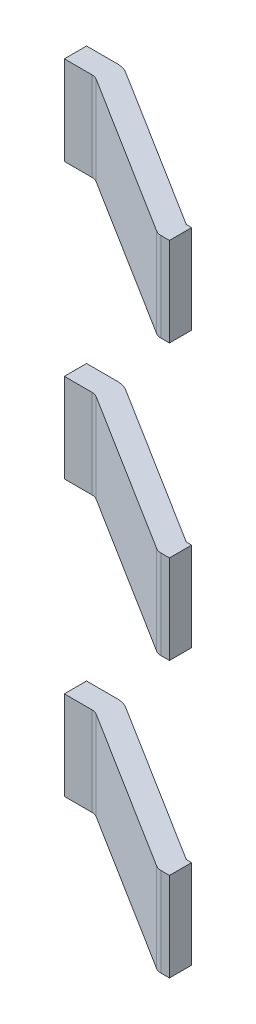
ISO-10303-21;
HEADER;
FILE_DESCRIPTION(('STEP AP214'),'2;1');
FILE_NAME('part.step','',(''),(''),'','','');
FILE_SCHEMA(('AUTOMOTIVE_DESIGN { 1 0 10303 214 1 1 1 1 }'));
ENDSEC;
DATA;
#1=APPLICATION_CONTEXT('core data for automotive mechanical design processes');
#2=APPLICATION_PROTOCOL_DEFINITION('international standard','automotive_design',2000,#1);
#3=PRODUCT_CONTEXT('',#1,'mechanical');
#4=PRODUCT('Part','Part','',(#3));
#5=PRODUCT_RELATED_PRODUCT_CATEGORY('part','',(#4));
#6=PRODUCT_DEFINITION_FORMATION('','',#4);
#7=PRODUCT_DEFINITION_CONTEXT('part definition',#1,'design');
#8=PRODUCT_DEFINITION('design','',#6,#7);
#9=PRODUCT_DEFINITION_SHAPE('','',#8);
#10=(LENGTH_UNIT() NAMED_UNIT(*) SI_UNIT(.MILLI.,.METRE.));
#11=(NAMED_UNIT(*) PLANE_ANGLE_UNIT() SI_UNIT($,.RADIAN.));
#12=(NAMED_UNIT(*) SI_UNIT($,.STERADIAN.) SOLID_ANGLE_UNIT());
#13=UNCERTAINTY_MEASURE_WITH_UNIT(LENGTH_MEASURE(1.E-05),#10,'distance_accuracy_value','');
#14=(GEOMETRIC_REPRESENTATION_CONTEXT(3) GLOBAL_UNCERTAINTY_ASSIGNED_CONTEXT((#13)) GLOBAL_UNIT_ASSIGNED_CONTEXT((#10,
#11,#12)) REPRESENTATION_CONTEXT('',''));
#15=CARTESIAN_POINT('',(0.,0.,0.));
#16=DIRECTION('',(0.,0.,1.));
#17=DIRECTION('',(1.,0.,0.));
#18=AXIS2_PLACEMENT_3D('',#15,#16,#17);
#19=CARTESIAN_POINT('',(-1.824104576066,1.92,0.964303036979));
#20=DIRECTION('',(0.,1.,0.));
#21=DIRECTION('',(-0.530661276733133,0.,0.847583983671212));
#22=AXIS2_PLACEMENT_3D('',#19,#20,#21);
#23=CYLINDRICAL_SURFACE('',#22,0.0925);
#24=CARTESIAN_POINT('',(-1.824104576066,1.92,0.964303036979));
#25=DIRECTION('',(0.,1.,0.));
#26=DIRECTION('',(0.,0.,1.));
#27=AXIS2_PLACEMENT_3D('',#24,#25,#26);
#28=CIRCLE('',#27,0.0925);
#29=CARTESIAN_POINT('',(-1.873190744164,1.92,1.042704555469));
#30=VERTEX_POINT('',#29);
#31=CARTESIAN_POINT('',(-1.824104576066,1.92,1.056803036979));
#32=VERTEX_POINT('',#31);
#33=EDGE_CURVE('P0_E127',#30,#32,#28,.T.);
#34=ORIENTED_EDGE('',*,*,#33,.T.);
#35=DIRECTION('',(0.,1.,0.));
#36=VECTOR('',#35,1.);
#37=CARTESIAN_POINT('',(-1.824104576066,1.92,1.056803036979));
#38=LINE('',#37,#36);
#39=CARTESIAN_POINT('',(-1.824104576066,2.66,1.056803036979));
#40=VERTEX_POINT('',#39);
#41=EDGE_CURVE('P0_E11',#32,#40,#38,.T.);
#42=ORIENTED_EDGE('',*,*,#41,.T.);
#43=CARTESIAN_POINT('',(-1.824104576066,2.66,0.964303036979));
#44=DIRECTION('',(0.,1.,0.));
#45=DIRECTION('',(0.,0.,1.));
#46=AXIS2_PLACEMENT_3D('',#43,#44,#45);
#47=CIRCLE('',#46,0.0925);
#48=CARTESIAN_POINT('',(-1.873190744164,2.66,1.042704555469));
#49=VERTEX_POINT('',#48);
#50=EDGE_CURVE('P0_E124',#49,#40,#47,.T.);
#51=ORIENTED_EDGE('',*,*,#50,.F.);
#52=DIRECTION('',(0.,1.,0.));
#53=VECTOR('',#52,1.);
#54=CARTESIAN_POINT('',(-1.873190744164,1.92,1.042704555469));
#55=LINE('',#54,#53);
#56=EDGE_CURVE('P0_E25',#30,#49,#55,.T.);
#57=ORIENTED_EDGE('',*,*,#56,.F.);
#58=EDGE_LOOP('',(#34,#42,#51,#57));
#59=FACE_BOUND('',#58,.T.);
#60=ADVANCED_FACE('P0_F17',(#59),#23,.T.);
#61=CARTESIAN_POINT('',(-1.850672336196,1.92,1.056803036979));
#62=DIRECTION('',(0.,0.,1.));
#63=DIRECTION('',(1.,0.,0.));
#64=AXIS2_PLACEMENT_3D('',#61,#62,#63);
#65=PLANE('',#64);
#66=DIRECTION('',(1.,0.,0.));
#67=VECTOR('',#66,1.);
#68=CARTESIAN_POINT('',(-1.850672336196,1.92,1.056803036979));
#69=LINE('',#68,#67);
#70=CARTESIAN_POINT('',(-1.7525,1.92,1.056803036979));
#71=VERTEX_POINT('',#70);
#72=EDGE_CURVE('P0_E193',#32,#71,#69,.T.);
#73=ORIENTED_EDGE('',*,*,#72,.T.);
#74=DIRECTION('',(0.,1.,0.));
#75=VECTOR('',#74,1.);
#76=CARTESIAN_POINT('',(-1.7525,1.92,1.056803036979));
#77=LINE('',#76,#75);
#78=CARTESIAN_POINT('',(-1.7525,2.66,1.056803036979));
#79=VERTEX_POINT('',#78);
#80=EDGE_CURVE('P0_E132',#71,#79,#77,.T.);
#81=ORIENTED_EDGE('',*,*,#80,.T.);
#82=DIRECTION('',(1.,0.,0.));
#83=VECTOR('',#82,1.);
#84=CARTESIAN_POINT('',(-1.850672336196,2.66,1.056803036979));
#85=LINE('',#84,#83);
#86=EDGE_CURVE('P0_E130',#40,#79,#85,.T.);
#87=ORIENTED_EDGE('',*,*,#86,.F.);
#88=ORIENTED_EDGE('',*,*,#41,.F.);
#89=EDGE_LOOP('',(#73,#81,#87,#88));
#90=FACE_BOUND('',#89,.T.);
#91=ADVANCED_FACE('P0_F131',(#90),#65,.T.);
#92=CARTESIAN_POINT('',(-3.288172336196,1.92,0.156803036979));
#93=DIRECTION('',(0.530661276733133,0.,-0.847583983671212));
#94=DIRECTION('',(0.,-1.,0.));
#95=AXIS2_PLACEMENT_3D('',#92,#93,#94);
#96=PLANE('',#95);
#97=ORIENTED_EDGE('',*,*,#56,.T.);
#98=DIRECTION('',(0.847583983671212,0.,0.530661276733133));
#99=VECTOR('',#98,1.);
#100=CARTESIAN_POINT('',(-3.288172336196,2.66,0.156803036979));
#101=LINE('',#100,#99);
#102=CARTESIAN_POINT('',(-3.220617112292,2.66,0.19909848151));
#103=VERTEX_POINT('',#102);
#104=EDGE_CURVE('P0_E143',#103,#49,#101,.T.);
#105=ORIENTED_EDGE('',*,*,#104,.F.);
#106=DIRECTION('',(0.,1.,0.));
#107=VECTOR('',#106,1.);
#108=CARTESIAN_POINT('',(-3.220617112292,1.92,0.19909848151));
#109=LINE('',#108,#107);
#110=CARTESIAN_POINT('',(-3.220617112292,1.92,0.19909848151));
#111=VERTEX_POINT('',#110);
#112=EDGE_CURVE('P0_E163',#111,#103,#109,.T.);
#113=ORIENTED_EDGE('',*,*,#112,.F.);
#114=DIRECTION('',(0.847583983671212,0.,0.530661276733133));
#115=VECTOR('',#114,1.);
#116=CARTESIAN_POINT('',(-3.288172336196,1.92,0.156803036979));
#117=LINE('',#116,#115);
#118=EDGE_CURVE('P0_E198',#111,#30,#117,.T.);
#119=ORIENTED_EDGE('',*,*,#118,.T.);
#120=EDGE_LOOP('',(#97,#105,#113,#119));
#121=FACE_BOUND('',#120,.T.);
#122=ADVANCED_FACE('P0_F218',(#121),#96,.F.);
#123=CARTESIAN_POINT('',(-1.7525,1.92,0.871803036979));
#124=DIRECTION('',(1.,0.,0.));
#125=DIRECTION('',(0.,1.,0.));
#126=AXIS2_PLACEMENT_3D('',#123,#124,#125);
#127=PLANE('',#126);
#128=DIRECTION('',(0.,0.,1.));
#129=VECTOR('',#128,1.);
#130=CARTESIAN_POINT('',(-1.7525,1.92,0.871803036979));
#131=LINE('',#130,#129);
#132=CARTESIAN_POINT('',(-1.7525,1.92,0.871803036979));
#133=VERTEX_POINT('',#132);
#134=EDGE_CURVE('P0_E189',#133,#71,#131,.T.);
#135=ORIENTED_EDGE('',*,*,#134,.F.);
#136=DIRECTION('',(0.,1.,0.));
#137=VECTOR('',#136,1.);
#138=CARTESIAN_POINT('',(-1.7525,1.92,0.871803036979));
#139=LINE('',#138,#137);
#140=CARTESIAN_POINT('',(-1.7525,2.66,0.871803036979));
#141=VERTEX_POINT('',#140);
#142=EDGE_CURVE('P0_E210',#133,#141,#139,.T.);
#143=ORIENTED_EDGE('',*,*,#142,.T.);
#144=DIRECTION('',(0.,0.,1.));
#145=VECTOR('',#144,1.);
#146=CARTESIAN_POINT('',(-1.7525,2.66,0.871803036979));
#147=LINE('',#146,#145);
#148=EDGE_CURVE('P0_E137',#141,#79,#147,.T.);
#149=ORIENTED_EDGE('',*,*,#148,.T.);
#150=ORIENTED_EDGE('',*,*,#80,.F.);
#151=EDGE_LOOP('',(#135,#143,#149,#150));
#152=FACE_BOUND('',#151,.T.);
#153=ADVANCED_FACE('P0_F226',(#152),#127,.T.);
#154=CARTESIAN_POINT('',(-1.850672336196,1.92,0.871803036979));
#155=DIRECTION('',(0.,0.,1.));
#156=DIRECTION('',(1.,0.,0.));
#157=AXIS2_PLACEMENT_3D('',#154,#155,#156);
#158=PLANE('',#157);
#159=ORIENTED_EDGE('',*,*,#142,.F.);
#160=DIRECTION('',(1.,0.,0.));
#161=VECTOR('',#160,1.);
#162=CARTESIAN_POINT('',(-1.850672336196,1.92,0.871803036979));
#163=LINE('',#162,#161);
#164=CARTESIAN_POINT('',(-1.797536815936,1.92,0.871803036979));
#165=VERTEX_POINT('',#164);
#166=EDGE_CURVE('P0_E185',#165,#133,#163,.T.);
#167=ORIENTED_EDGE('',*,*,#166,.F.);
#168=DIRECTION('',(0.,1.,0.));
#169=VECTOR('',#168,1.);
#170=CARTESIAN_POINT('',(-1.797536815936,1.92,0.871803036979));
#171=LINE('',#170,#169);
#172=CARTESIAN_POINT('',(-1.797536815936,2.66,0.871803036979));
#173=VERTEX_POINT('',#172);
#174=EDGE_CURVE('P0_E207',#165,#173,#171,.T.);
#175=ORIENTED_EDGE('',*,*,#174,.T.);
#176=DIRECTION('',(1.,0.,0.));
#177=VECTOR('',#176,1.);
#178=CARTESIAN_POINT('',(-1.850672336196,2.66,0.871803036979));
#179=LINE('',#178,#177);
#180=EDGE_CURVE('P0_E154',#173,#141,#179,.T.);
#181=ORIENTED_EDGE('',*,*,#180,.T.);
#182=EDGE_LOOP('',(#159,#167,#175,#181));
#183=FACE_BOUND('',#182,.T.);
#184=ADVANCED_FACE('P0_F369',(#183),#158,.F.);
#185=CARTESIAN_POINT('',(-3.19,1.92,0.));
#186=DIRECTION('',(0.530661276733133,0.,-0.847583983671212));
#187=DIRECTION('',(0.,-1.,0.));
#188=AXIS2_PLACEMENT_3D('',#185,#186,#187);
#189=PLANE('',#188);
#190=DIRECTION('',(0.847583983671212,0.,0.530661276733133));
#191=VECTOR('',#190,1.);
#192=CARTESIAN_POINT('',(-3.19,1.92,0.));
#193=LINE('',#192,#191);
#194=CARTESIAN_POINT('',(-3.144963184064,1.92,0.02819696302084));
#195=VERTEX_POINT('',#194);
#196=EDGE_CURVE('P0_E181',#195,#165,#193,.T.);
#197=ORIENTED_EDGE('',*,*,#196,.F.);
#198=DIRECTION('',(0.,1.,0.));
#199=VECTOR('',#198,1.);
#200=CARTESIAN_POINT('',(-3.144963184064,1.92,0.02819696302084));
#201=LINE('',#200,#199);
#202=CARTESIAN_POINT('',(-3.144963184064,2.66,0.02819696302084));
#203=VERTEX_POINT('',#202);
#204=EDGE_CURVE('P0_E204',#195,#203,#201,.T.);
#205=ORIENTED_EDGE('',*,*,#204,.T.);
#206=DIRECTION('',(0.847583983671212,0.,0.530661276733133));
#207=VECTOR('',#206,1.);
#208=CARTESIAN_POINT('',(-3.19,2.66,0.));
#209=LINE('',#208,#207);
#210=EDGE_CURVE('P0_E156',#203,#173,#209,.T.);
#211=ORIENTED_EDGE('',*,*,#210,.T.);
#212=ORIENTED_EDGE('',*,*,#174,.F.);
#213=EDGE_LOOP('',(#197,#205,#211,#212));
#214=FACE_BOUND('',#213,.T.);
#215=ADVANCED_FACE('P0_F332',(#214),#189,.T.);
#216=CARTESIAN_POINT('',(-3.24313552026,1.92,0.185));
#217=DIRECTION('',(0.,1.,0.));
#218=DIRECTION('',(0.,0.,-1.));
#219=AXIS2_PLACEMENT_3D('',#216,#217,#218);
#220=CYLINDRICAL_SURFACE('',#219,0.185);
#221=DIRECTION('',(0.,1.,0.));
#222=VECTOR('',#221,1.);
#223=CARTESIAN_POINT('',(-3.24313552026,1.92,0.));
#224=LINE('',#223,#222);
#225=CARTESIAN_POINT('',(-3.24313552026,1.92,0.));
#226=VERTEX_POINT('',#225);
#227=CARTESIAN_POINT('',(-3.24313552026,2.66,0.));
#228=VERTEX_POINT('',#227);
#229=EDGE_CURVE('P0_E201',#226,#228,#224,.T.);
#230=ORIENTED_EDGE('',*,*,#229,.T.);
#231=CARTESIAN_POINT('',(-3.24313552026,2.66,0.185));
#232=DIRECTION('',(0.,-1.,0.));
#233=DIRECTION('',(0.,0.,1.));
#234=AXIS2_PLACEMENT_3D('',#231,#232,#233);
#235=CIRCLE('',#234,0.185);
#236=EDGE_CURVE('P0_E159',#228,#203,#235,.T.);
#237=ORIENTED_EDGE('',*,*,#236,.T.);
#238=ORIENTED_EDGE('',*,*,#204,.F.);
#239=CARTESIAN_POINT('',(-3.24313552026,1.92,0.185));
#240=DIRECTION('',(0.,-1.,0.));
#241=DIRECTION('',(0.,0.,1.));
#242=AXIS2_PLACEMENT_3D('',#239,#240,#241);
#243=CIRCLE('',#242,0.185);
#244=EDGE_CURVE('P0_E177',#226,#195,#243,.T.);
#245=ORIENTED_EDGE('',*,*,#244,.F.);
#246=EDGE_LOOP('',(#230,#237,#238,#245));
#247=FACE_BOUND('',#246,.T.);
#248=ADVANCED_FACE('P0_F326',(#247),#220,.T.);
#249=CARTESIAN_POINT('',(-3.5,1.92,0.));
#250=DIRECTION('',(0.,0.,1.));
#251=DIRECTION('',(1.,0.,0.));
#252=AXIS2_PLACEMENT_3D('',#249,#250,#251);
#253=PLANE('',#252);
#254=ORIENTED_EDGE('',*,*,#229,.F.);
#255=DIRECTION('',(1.,0.,0.));
#256=VECTOR('',#255,1.);
#257=CARTESIAN_POINT('',(-3.5,1.92,0.));
#258=LINE('',#257,#256);
#259=CARTESIAN_POINT('',(-3.5,1.92,0.));
#260=VERTEX_POINT('',#259);
#261=EDGE_CURVE('P0_E173',#260,#226,#258,.T.);
#262=ORIENTED_EDGE('',*,*,#261,.F.);
#263=DIRECTION('',(0.,1.,0.));
#264=VECTOR('',#263,1.);
#265=CARTESIAN_POINT('',(-3.5,1.92,0.));
#266=LINE('',#265,#264);
#267=CARTESIAN_POINT('',(-3.5,2.66,0.));
#268=VERTEX_POINT('',#267);
#269=EDGE_CURVE('P0_E166',#260,#268,#266,.T.);
#270=ORIENTED_EDGE('',*,*,#269,.T.);
#271=DIRECTION('',(1.,0.,0.));
#272=VECTOR('',#271,1.);
#273=CARTESIAN_POINT('',(-3.5,2.66,0.));
#274=LINE('',#273,#272);
#275=EDGE_CURVE('P0_E461',#268,#228,#274,.T.);
#276=ORIENTED_EDGE('',*,*,#275,.T.);
#277=EDGE_LOOP('',(#254,#262,#270,#276));
#278=FACE_BOUND('',#277,.T.);
#279=ADVANCED_FACE('P0_F331',(#278),#253,.F.);
#280=CARTESIAN_POINT('',(-2.614100714426,1.92,0.486101794686));
#281=DIRECTION('',(0.,-1.,0.));
#282=DIRECTION('',(0.,0.,-1.));
#283=AXIS2_PLACEMENT_3D('',#280,#281,#282);
#284=PLANE('',#283);
#285=ORIENTED_EDGE('',*,*,#261,.T.);
#286=ORIENTED_EDGE('',*,*,#244,.T.);
#287=ORIENTED_EDGE('',*,*,#196,.T.);
#288=ORIENTED_EDGE('',*,*,#166,.T.);
#289=ORIENTED_EDGE('',*,*,#134,.T.);
#290=ORIENTED_EDGE('',*,*,#72,.F.);
#291=ORIENTED_EDGE('',*,*,#33,.F.);
#292=ORIENTED_EDGE('',*,*,#118,.F.);
#293=CARTESIAN_POINT('',(-3.269703280389,1.92,0.2775));
#294=DIRECTION('',(0.,-1.,0.));
#295=DIRECTION('',(0.,0.,1.));
#296=AXIS2_PLACEMENT_3D('',#293,#294,#295);
#297=CIRCLE('',#296,0.0925);
#298=CARTESIAN_POINT('',(-3.269703280389,1.92,0.185));
#299=VERTEX_POINT('',#298);
#300=EDGE_CURVE('P0_E167',#299,#111,#297,.T.);
#301=ORIENTED_EDGE('',*,*,#300,.F.);
#302=DIRECTION('',(1.,0.,0.));
#303=VECTOR('',#302,1.);
#304=CARTESIAN_POINT('',(-3.5,1.92,0.185));
#305=LINE('',#304,#303);
#306=CARTESIAN_POINT('',(-3.5,1.92,0.185));
#307=VERTEX_POINT('',#306);
#308=EDGE_CURVE('P0_E463',#307,#299,#305,.T.);
#309=ORIENTED_EDGE('',*,*,#308,.F.);
#310=DIRECTION('',(0.,0.,1.));
#311=VECTOR('',#310,1.);
#312=CARTESIAN_POINT('',(-3.5,1.92,0.));
#313=LINE('',#312,#311);
#314=EDGE_CURVE('P0_E170',#260,#307,#313,.T.);
#315=ORIENTED_EDGE('',*,*,#314,.F.);
#316=EDGE_LOOP('',(#285,#286,#287,#288,#289,#290,#291,#292,#301,#309,#315));
#317=FACE_BOUND('',#316,.T.);
#318=ADVANCED_FACE('P0_F222',(#317),#284,.T.);
#319=CARTESIAN_POINT('',(-3.5,1.92,0.));
#320=DIRECTION('',(1.,0.,0.));
#321=DIRECTION('',(0.,1.,0.));
#322=AXIS2_PLACEMENT_3D('',#319,#320,#321);
#323=PLANE('',#322);
#324=DIRECTION('',(0.,1.,0.));
#325=VECTOR('',#324,1.);
#326=CARTESIAN_POINT('',(-3.5,1.92,0.185));
#327=LINE('',#326,#325);
#328=CARTESIAN_POINT('',(-3.5,2.66,0.185));
#329=VERTEX_POINT('',#328);
#330=EDGE_CURVE('P0_E468',#307,#329,#327,.T.);
#331=ORIENTED_EDGE('',*,*,#330,.T.);
#332=DIRECTION('',(0.,0.,1.));
#333=VECTOR('',#332,1.);
#334=CARTESIAN_POINT('',(-3.5,2.66,0.));
#335=LINE('',#334,#333);
#336=EDGE_CURVE('P0_E459',#268,#329,#335,.T.);
#337=ORIENTED_EDGE('',*,*,#336,.F.);
#338=ORIENTED_EDGE('',*,*,#269,.F.);
#339=ORIENTED_EDGE('',*,*,#314,.T.);
#340=EDGE_LOOP('',(#331,#337,#338,#339));
#341=FACE_BOUND('',#340,.T.);
#342=ADVANCED_FACE('P0_F311',(#341),#323,.F.);
#343=CARTESIAN_POINT('',(-3.269703280389,1.92,0.2775));
#344=DIRECTION('',(0.,1.,0.));
#345=DIRECTION('',(0.,0.,-1.));
#346=AXIS2_PLACEMENT_3D('',#343,#344,#345);
#347=CYLINDRICAL_SURFACE('',#346,0.0925);
#348=ORIENTED_EDGE('',*,*,#300,.T.);
#349=ORIENTED_EDGE('',*,*,#112,.T.);
#350=CARTESIAN_POINT('',(-3.269703280389,2.66,0.2775));
#351=DIRECTION('',(0.,-1.,0.));
#352=DIRECTION('',(0.,0.,1.));
#353=AXIS2_PLACEMENT_3D('',#350,#351,#352);
#354=CIRCLE('',#353,0.0925);
#355=CARTESIAN_POINT('',(-3.269703280389,2.66,0.185));
#356=VERTEX_POINT('',#355);
#357=EDGE_CURVE('P0_E150',#356,#103,#354,.T.);
#358=ORIENTED_EDGE('',*,*,#357,.F.);
#359=DIRECTION('',(0.,1.,0.));
#360=VECTOR('',#359,1.);
#361=CARTESIAN_POINT('',(-3.269703280389,1.92,0.185));
#362=LINE('',#361,#360);
#363=EDGE_CURVE('P0_E467',#299,#356,#362,.T.);
#364=ORIENTED_EDGE('',*,*,#363,.F.);
#365=EDGE_LOOP('',(#348,#349,#358,#364));
#366=FACE_BOUND('',#365,.T.);
#367=ADVANCED_FACE('P0_F306',(#366),#347,.F.);
#368=CARTESIAN_POINT('',(-2.614100714426,2.66,0.486101794686));
#369=DIRECTION('',(0.,1.,0.));
#370=DIRECTION('',(0.,0.,-1.));
#371=AXIS2_PLACEMENT_3D('',#368,#369,#370);
#372=PLANE('',#371);
#373=ORIENTED_EDGE('',*,*,#275,.F.);
#374=ORIENTED_EDGE('',*,*,#336,.T.);
#375=DIRECTION('',(1.,0.,0.));
#376=VECTOR('',#375,1.);
#377=CARTESIAN_POINT('',(-3.5,2.66,0.185));
#378=LINE('',#377,#376);
#379=EDGE_CURVE('P0_E472',#329,#356,#378,.T.);
#380=ORIENTED_EDGE('',*,*,#379,.T.);
#381=ORIENTED_EDGE('',*,*,#357,.T.);
#382=ORIENTED_EDGE('',*,*,#104,.T.);
#383=ORIENTED_EDGE('',*,*,#50,.T.);
#384=ORIENTED_EDGE('',*,*,#86,.T.);
#385=ORIENTED_EDGE('',*,*,#148,.F.);
#386=ORIENTED_EDGE('',*,*,#180,.F.);
#387=ORIENTED_EDGE('',*,*,#210,.F.);
#388=ORIENTED_EDGE('',*,*,#236,.F.);
#389=EDGE_LOOP('',(#373,#374,#380,#381,#382,#383,#384,#385,#386,#387,#388));
#390=FACE_BOUND('',#389,.T.);
#391=ADVANCED_FACE('P0_F140',(#390),#372,.T.);
#392=CARTESIAN_POINT('',(-3.5,1.92,0.185));
#393=DIRECTION('',(0.,0.,1.));
#394=DIRECTION('',(1.,0.,0.));
#395=AXIS2_PLACEMENT_3D('',#392,#393,#394);
#396=PLANE('',#395);
#397=ORIENTED_EDGE('',*,*,#379,.F.);
#398=ORIENTED_EDGE('',*,*,#330,.F.);
#399=ORIENTED_EDGE('',*,*,#308,.T.);
#400=ORIENTED_EDGE('',*,*,#363,.T.);
#401=EDGE_LOOP('',(#397,#398,#399,#400));
#402=FACE_BOUND('',#401,.T.);
#403=ADVANCED_FACE('P0_F318',(#402),#396,.T.);
#404=CLOSED_SHELL('',(#60,#91,#122,#153,#184,#215,#248,#279,#318,#342,#367,#391,#403));
#405=MANIFOLD_SOLID_BREP('P0_B1',#404);
#406=CARTESIAN_POINT('',(-1.824104576066,-0.37,0.964303036979));
#407=DIRECTION('',(0.,1.,0.));
#408=DIRECTION('',(-0.530661276733133,0.,0.847583983671212));
#409=AXIS2_PLACEMENT_3D('',#406,#407,#408);
#410=CYLINDRICAL_SURFACE('',#409,0.0925);
#411=CARTESIAN_POINT('',(-1.824104576066,-0.37,0.964303036979));
#412=DIRECTION('',(0.,1.,0.));
#413=DIRECTION('',(0.,0.,1.));
#414=AXIS2_PLACEMENT_3D('',#411,#412,#413);
#415=CIRCLE('',#414,0.0925);
#416=CARTESIAN_POINT('',(-1.873190744164,-0.37,1.042704555469));
#417=VERTEX_POINT('',#416);
#418=CARTESIAN_POINT('',(-1.824104576066,-0.37,1.056803036979));
#419=VERTEX_POINT('',#418);
#420=EDGE_CURVE('P1_E244',#417,#419,#415,.T.);
#421=ORIENTED_EDGE('',*,*,#420,.T.);
#422=DIRECTION('',(0.,1.,0.));
#423=VECTOR('',#422,1.);
#424=CARTESIAN_POINT('',(-1.824104576066,-0.37,1.056803036979));
#425=LINE('',#424,#423);
#426=CARTESIAN_POINT('',(-1.824104576066,0.37,1.056803036979));
#427=VERTEX_POINT('',#426);
#428=EDGE_CURVE('P1_E11',#419,#427,#425,.T.);
#429=ORIENTED_EDGE('',*,*,#428,.T.);
#430=CARTESIAN_POINT('',(-1.824104576066,0.37,0.964303036979));
#431=DIRECTION('',(0.,1.,0.));
#432=DIRECTION('',(0.,0.,1.));
#433=AXIS2_PLACEMENT_3D('',#430,#431,#432);
#434=CIRCLE('',#433,0.0925);
#435=CARTESIAN_POINT('',(-1.873190744164,0.37,1.042704555469));
#436=VERTEX_POINT('',#435);
#437=EDGE_CURVE('P1_E188',#436,#427,#434,.T.);
#438=ORIENTED_EDGE('',*,*,#437,.F.);
#439=DIRECTION('',(0.,1.,0.));
#440=VECTOR('',#439,1.);
#441=CARTESIAN_POINT('',(-1.873190744164,-0.37,1.042704555469));
#442=LINE('',#441,#440);
#443=EDGE_CURVE('P1_E27',#417,#436,#442,.T.);
#444=ORIENTED_EDGE('',*,*,#443,.F.);
#445=EDGE_LOOP('',(#421,#429,#438,#444));
#446=FACE_BOUND('',#445,.T.);
#447=ADVANCED_FACE('P1_F17',(#446),#410,.T.);
#448=CARTESIAN_POINT('',(-1.850672336196,-0.37,1.056803036979));
#449=DIRECTION('',(0.,0.,1.));
#450=DIRECTION('',(1.,0.,0.));
#451=AXIS2_PLACEMENT_3D('',#448,#449,#450);
#452=PLANE('',#451);
#453=DIRECTION('',(1.,0.,0.));
#454=VECTOR('',#453,1.);
#455=CARTESIAN_POINT('',(-1.850672336196,-0.37,1.056803036979));
#456=LINE('',#455,#454);
#457=CARTESIAN_POINT('',(-1.7525,-0.37,1.056803036979));
#458=VERTEX_POINT('',#457);
#459=EDGE_CURVE('P1_E241',#419,#458,#456,.T.);
#460=ORIENTED_EDGE('',*,*,#459,.T.);
#461=DIRECTION('',(0.,1.,0.));
#462=VECTOR('',#461,1.);
#463=CARTESIAN_POINT('',(-1.7525,-0.37,1.056803036979));
#464=LINE('',#463,#462);
#465=CARTESIAN_POINT('',(-1.7525,0.37,1.056803036979));
#466=VERTEX_POINT('',#465);
#467=EDGE_CURVE('P1_E21',#458,#466,#464,.T.);
#468=ORIENTED_EDGE('',*,*,#467,.T.);
#469=DIRECTION('',(1.,0.,0.));
#470=VECTOR('',#469,1.);
#471=CARTESIAN_POINT('',(-1.850672336196,0.37,1.056803036979));
#472=LINE('',#471,#470);
#473=EDGE_CURVE('P1_E192',#427,#466,#472,.T.);
#474=ORIENTED_EDGE('',*,*,#473,.F.);
#475=ORIENTED_EDGE('',*,*,#428,.F.);
#476=EDGE_LOOP('',(#460,#468,#474,#475));
#477=FACE_BOUND('',#476,.T.);
#478=ADVANCED_FACE('P1_F19',(#477),#452,.T.);
#479=CARTESIAN_POINT('',(-3.288172336196,-0.37,0.156803036979));
#480=DIRECTION('',(0.530661276733133,0.,-0.847583983671212));
#481=DIRECTION('',(0.,-1.,0.));
#482=AXIS2_PLACEMENT_3D('',#479,#480,#481);
#483=PLANE('',#482);
#484=ORIENTED_EDGE('',*,*,#443,.T.);
#485=DIRECTION('',(0.847583983671212,0.,0.530661276733133));
#486=VECTOR('',#485,1.);
#487=CARTESIAN_POINT('',(-3.288172336196,0.37,0.156803036979));
#488=LINE('',#487,#486);
#489=CARTESIAN_POINT('',(-3.220617112292,0.37,0.19909848151));
#490=VERTEX_POINT('',#489);
#491=EDGE_CURVE('P1_E171',#490,#436,#488,.T.);
#492=ORIENTED_EDGE('',*,*,#491,.F.);
#493=DIRECTION('',(0.,1.,0.));
#494=VECTOR('',#493,1.);
#495=CARTESIAN_POINT('',(-3.220617112292,-0.37,0.19909848151));
#496=LINE('',#495,#494);
#497=CARTESIAN_POINT('',(-3.220617112292,-0.37,0.19909848151));
#498=VERTEX_POINT('',#497);
#499=EDGE_CURVE('P1_E197',#498,#490,#496,.T.);
#500=ORIENTED_EDGE('',*,*,#499,.F.);
#501=DIRECTION('',(0.847583983671212,0.,0.530661276733133));
#502=VECTOR('',#501,1.);
#503=CARTESIAN_POINT('',(-3.288172336196,-0.37,0.156803036979));
#504=LINE('',#503,#502);
#505=EDGE_CURVE('P1_E249',#498,#417,#504,.T.);
#506=ORIENTED_EDGE('',*,*,#505,.T.);
#507=EDGE_LOOP('',(#484,#492,#500,#506));
#508=FACE_BOUND('',#507,.T.);
#509=ADVANCED_FACE('P1_F282',(#508),#483,.F.);
#510=CARTESIAN_POINT('',(-1.7525,-0.37,0.871803036979));
#511=DIRECTION('',(1.,0.,0.));
#512=DIRECTION('',(0.,1.,0.));
#513=AXIS2_PLACEMENT_3D('',#510,#511,#512);
#514=PLANE('',#513);
#515=DIRECTION('',(0.,0.,1.));
#516=VECTOR('',#515,1.);
#517=CARTESIAN_POINT('',(-1.7525,-0.37,0.871803036979));
#518=LINE('',#517,#516);
#519=CARTESIAN_POINT('',(-1.7525,-0.37,0.871803036979));
#520=VERTEX_POINT('',#519);
#521=EDGE_CURVE('P1_E237',#520,#458,#518,.T.);
#522=ORIENTED_EDGE('',*,*,#521,.F.);
#523=DIRECTION('',(0.,1.,0.));
#524=VECTOR('',#523,1.);
#525=CARTESIAN_POINT('',(-1.7525,-0.37,0.871803036979));
#526=LINE('',#525,#524);
#527=CARTESIAN_POINT('',(-1.7525,0.37,0.871803036979));
#528=VERTEX_POINT('',#527);
#529=EDGE_CURVE('P1_E211',#520,#528,#526,.T.);
#530=ORIENTED_EDGE('',*,*,#529,.T.);
#531=DIRECTION('',(0.,0.,1.));
#532=VECTOR('',#531,1.);
#533=CARTESIAN_POINT('',(-1.7525,0.37,0.871803036979));
#534=LINE('',#533,#532);
#535=EDGE_CURVE('P1_E196',#528,#466,#534,.T.);
#536=ORIENTED_EDGE('',*,*,#535,.T.);
#537=ORIENTED_EDGE('',*,*,#467,.F.);
#538=EDGE_LOOP('',(#522,#530,#536,#537));
#539=FACE_BOUND('',#538,.T.);
#540=ADVANCED_FACE('P1_F267',(#539),#514,.T.);
#541=CARTESIAN_POINT('',(-1.850672336196,-0.37,0.871803036979));
#542=DIRECTION('',(0.,0.,1.));
#543=DIRECTION('',(1.,0.,0.));
#544=AXIS2_PLACEMENT_3D('',#541,#542,#543);
#545=PLANE('',#544);
#546=ORIENTED_EDGE('',*,*,#529,.F.);
#547=DIRECTION('',(1.,0.,0.));
#548=VECTOR('',#547,1.);
#549=CARTESIAN_POINT('',(-1.850672336196,-0.37,0.871803036979));
#550=LINE('',#549,#548);
#551=CARTESIAN_POINT('',(-1.797536815936,-0.37,0.871803036979));
#552=VERTEX_POINT('',#551);
#553=EDGE_CURVE('P1_E233',#552,#520,#550,.T.);
#554=ORIENTED_EDGE('',*,*,#553,.F.);
#555=DIRECTION('',(0.,1.,0.));
#556=VECTOR('',#555,1.);
#557=CARTESIAN_POINT('',(-1.797536815936,-0.37,0.871803036979));
#558=LINE('',#557,#556);
#559=CARTESIAN_POINT('',(-1.797536815936,0.37,0.871803036979));
#560=VERTEX_POINT('',#559);
#561=EDGE_CURVE('P1_E177',#552,#560,#558,.T.);
#562=ORIENTED_EDGE('',*,*,#561,.T.);
#563=DIRECTION('',(1.,0.,0.));
#564=VECTOR('',#563,1.);
#565=CARTESIAN_POINT('',(-1.850672336196,0.37,0.871803036979));
#566=LINE('',#565,#564);
#567=EDGE_CURVE('P1_E183',#560,#528,#566,.T.);
#568=ORIENTED_EDGE('',*,*,#567,.T.);
#569=EDGE_LOOP('',(#546,#554,#562,#568));
#570=FACE_BOUND('',#569,.T.);
#571=ADVANCED_FACE('P1_F258',(#570),#545,.F.);
#572=CARTESIAN_POINT('',(-3.19,-0.37,0.));
#573=DIRECTION('',(0.530661276733133,0.,-0.847583983671212));
#574=DIRECTION('',(0.,-1.,0.));
#575=AXIS2_PLACEMENT_3D('',#572,#573,#574);
#576=PLANE('',#575);
#577=DIRECTION('',(0.847583983671212,0.,0.530661276733133));
#578=VECTOR('',#577,1.);
#579=CARTESIAN_POINT('',(-3.19,-0.37,0.));
#580=LINE('',#579,#578);
#581=CARTESIAN_POINT('',(-3.144963184064,-0.37,0.02819696302084));
#582=VERTEX_POINT('',#581);
#583=EDGE_CURVE('P1_E229',#582,#552,#580,.T.);
#584=ORIENTED_EDGE('',*,*,#583,.F.);
#585=DIRECTION('',(0.,1.,0.));
#586=VECTOR('',#585,1.);
#587=CARTESIAN_POINT('',(-3.144963184064,-0.37,0.02819696302084));
#588=LINE('',#587,#586);
#589=CARTESIAN_POINT('',(-3.144963184064,0.37,0.02819696302084));
#590=VERTEX_POINT('',#589);
#591=EDGE_CURVE('P1_E174',#582,#590,#588,.T.);
#592=ORIENTED_EDGE('',*,*,#591,.T.);
#593=DIRECTION('',(0.847583983671212,0.,0.530661276733133));
#594=VECTOR('',#593,1.);
#595=CARTESIAN_POINT('',(-3.19,0.37,0.));
#596=LINE('',#595,#594);
#597=EDGE_CURVE('P1_E179',#590,#560,#596,.T.);
#598=ORIENTED_EDGE('',*,*,#597,.T.);
#599=ORIENTED_EDGE('',*,*,#561,.F.);
#600=EDGE_LOOP('',(#584,#592,#598,#599));
#601=FACE_BOUND('',#600,.T.);
#602=ADVANCED_FACE('P1_F264',(#601),#576,.T.);
#603=CARTESIAN_POINT('',(-3.24313552026,-0.37,0.185));
#604=DIRECTION('',(0.,1.,0.));
#605=DIRECTION('',(0.,0.,-1.));
#606=AXIS2_PLACEMENT_3D('',#603,#604,#605);
#607=CYLINDRICAL_SURFACE('',#606,0.185);
#608=DIRECTION('',(0.,1.,0.));
#609=VECTOR('',#608,1.);
#610=CARTESIAN_POINT('',(-3.24313552026,-0.37,0.));
#611=LINE('',#610,#609);
#612=CARTESIAN_POINT('',(-3.24313552026,-0.37,0.));
#613=VERTEX_POINT('',#612);
#614=CARTESIAN_POINT('',(-3.24313552026,0.37,0.));
#615=VERTEX_POINT('',#614);
#616=EDGE_CURVE('P1_E178',#613,#615,#611,.T.);
#617=ORIENTED_EDGE('',*,*,#616,.T.);
#618=CARTESIAN_POINT('',(-3.24313552026,0.37,0.185));
#619=DIRECTION('',(0.,-1.,0.));
#620=DIRECTION('',(0.,0.,1.));
#621=AXIS2_PLACEMENT_3D('',#618,#619,#620);
#622=CIRCLE('',#621,0.185);
#623=EDGE_CURVE('P1_E182',#615,#590,#622,.T.);
#624=ORIENTED_EDGE('',*,*,#623,.T.);
#625=ORIENTED_EDGE('',*,*,#591,.F.);
#626=CARTESIAN_POINT('',(-3.24313552026,-0.37,0.185));
#627=DIRECTION('',(0.,-1.,0.));
#628=DIRECTION('',(0.,0.,1.));
#629=AXIS2_PLACEMENT_3D('',#626,#627,#628);
#630=CIRCLE('',#629,0.185);
#631=EDGE_CURVE('P1_E225',#613,#582,#630,.T.);
#632=ORIENTED_EDGE('',*,*,#631,.F.);
#633=EDGE_LOOP('',(#617,#624,#625,#632));
#634=FACE_BOUND('',#633,.T.);
#635=ADVANCED_FACE('P1_F273',(#634),#607,.T.);
#636=CARTESIAN_POINT('',(-3.5,-0.37,0.));
#637=DIRECTION('',(0.,0.,1.));
#638=DIRECTION('',(1.,0.,0.));
#639=AXIS2_PLACEMENT_3D('',#636,#637,#638);
#640=PLANE('',#639);
#641=ORIENTED_EDGE('',*,*,#616,.F.);
#642=DIRECTION('',(1.,0.,0.));
#643=VECTOR('',#642,1.);
#644=CARTESIAN_POINT('',(-3.5,-0.37,0.));
#645=LINE('',#644,#643);
#646=CARTESIAN_POINT('',(-3.5,-0.37,0.));
#647=VERTEX_POINT('',#646);
#648=EDGE_CURVE('P1_E207',#647,#613,#645,.T.);
#649=ORIENTED_EDGE('',*,*,#648,.F.);
#650=DIRECTION('',(0.,1.,0.));
#651=VECTOR('',#650,1.);
#652=CARTESIAN_POINT('',(-3.5,-0.37,0.));
#653=LINE('',#652,#651);
#654=CARTESIAN_POINT('',(-3.5,0.37,0.));
#655=VERTEX_POINT('',#654);
#656=EDGE_CURVE('P1_E200',#647,#655,#653,.T.);
#657=ORIENTED_EDGE('',*,*,#656,.T.);
#658=DIRECTION('',(1.,0.,0.));
#659=VECTOR('',#658,1.);
#660=CARTESIAN_POINT('',(-3.5,0.37,0.));
#661=LINE('',#660,#659);
#662=EDGE_CURVE('P1_E138',#655,#615,#661,.T.);
#663=ORIENTED_EDGE('',*,*,#662,.T.);
#664=EDGE_LOOP('',(#641,#649,#657,#663));
#665=FACE_BOUND('',#664,.T.);
#666=ADVANCED_FACE('P1_F275',(#665),#640,.F.);
#667=CARTESIAN_POINT('',(-2.614100714426,-0.37,0.486101794686));
#668=DIRECTION('',(0.,-1.,0.));
#669=DIRECTION('',(0.,0.,-1.));
#670=AXIS2_PLACEMENT_3D('',#667,#668,#669);
#671=PLANE('',#670);
#672=ORIENTED_EDGE('',*,*,#648,.T.);
#673=ORIENTED_EDGE('',*,*,#631,.T.);
#674=ORIENTED_EDGE('',*,*,#583,.T.);
#675=ORIENTED_EDGE('',*,*,#553,.T.);
#676=ORIENTED_EDGE('',*,*,#521,.T.);
#677=ORIENTED_EDGE('',*,*,#459,.F.);
#678=ORIENTED_EDGE('',*,*,#420,.F.);
#679=ORIENTED_EDGE('',*,*,#505,.F.);
#680=CARTESIAN_POINT('',(-3.269703280389,-0.37,0.2775));
#681=DIRECTION('',(0.,-1.,0.));
#682=DIRECTION('',(0.,0.,1.));
#683=AXIS2_PLACEMENT_3D('',#680,#681,#682);
#684=CIRCLE('',#683,0.0925);
#685=CARTESIAN_POINT('',(-3.269703280389,-0.37,0.185));
#686=VERTEX_POINT('',#685);
#687=EDGE_CURVE('P1_E201',#686,#498,#684,.T.);
#688=ORIENTED_EDGE('',*,*,#687,.F.);
#689=DIRECTION('',(1.,0.,0.));
#690=VECTOR('',#689,1.);
#691=CARTESIAN_POINT('',(-3.5,-0.37,0.185));
#692=LINE('',#691,#690);
#693=CARTESIAN_POINT('',(-3.5,-0.37,0.185));
#694=VERTEX_POINT('',#693);
#695=EDGE_CURVE('P1_E153',#694,#686,#692,.T.);
#696=ORIENTED_EDGE('',*,*,#695,.F.);
#697=DIRECTION('',(0.,0.,1.));
#698=VECTOR('',#697,1.);
#699=CARTESIAN_POINT('',(-3.5,-0.37,0.));
#700=LINE('',#699,#698);
#701=EDGE_CURVE('P1_E148',#647,#694,#700,.T.);
#702=ORIENTED_EDGE('',*,*,#701,.F.);
#703=EDGE_LOOP('',(#672,#673,#674,#675,#676,#677,#678,#679,#688,#696,#702));
#704=FACE_BOUND('',#703,.T.);
#705=ADVANCED_FACE('P1_F270',(#704),#671,.T.);
#706=CARTESIAN_POINT('',(-3.5,-0.37,0.));
#707=DIRECTION('',(1.,0.,0.));
#708=DIRECTION('',(0.,1.,0.));
#709=AXIS2_PLACEMENT_3D('',#706,#707,#708);
#710=PLANE('',#709);
#711=DIRECTION('',(0.,1.,0.));
#712=VECTOR('',#711,1.);
#713=CARTESIAN_POINT('',(-3.5,-0.37,0.185));
#714=LINE('',#713,#712);
#715=CARTESIAN_POINT('',(-3.5,0.37,0.185));
#716=VERTEX_POINT('',#715);
#717=EDGE_CURVE('P1_E145',#694,#716,#714,.T.);
#718=ORIENTED_EDGE('',*,*,#717,.T.);
#719=DIRECTION('',(0.,0.,1.));
#720=VECTOR('',#719,1.);
#721=CARTESIAN_POINT('',(-3.5,0.37,0.));
#722=LINE('',#721,#720);
#723=EDGE_CURVE('P1_E130',#655,#716,#722,.T.);
#724=ORIENTED_EDGE('',*,*,#723,.F.);
#725=ORIENTED_EDGE('',*,*,#656,.F.);
#726=ORIENTED_EDGE('',*,*,#701,.T.);
#727=EDGE_LOOP('',(#718,#724,#725,#726));
#728=FACE_BOUND('',#727,.T.);
#729=ADVANCED_FACE('P1_F146',(#728),#710,.F.);
#730=CARTESIAN_POINT('',(-3.269703280389,-0.37,0.2775));
#731=DIRECTION('',(0.,1.,0.));
#732=DIRECTION('',(0.,0.,-1.));
#733=AXIS2_PLACEMENT_3D('',#730,#731,#732);
#734=CYLINDRICAL_SURFACE('',#733,0.0925);
#735=ORIENTED_EDGE('',*,*,#687,.T.);
#736=ORIENTED_EDGE('',*,*,#499,.T.);
#737=CARTESIAN_POINT('',(-3.269703280389,0.37,0.2775));
#738=DIRECTION('',(0.,-1.,0.));
#739=DIRECTION('',(0.,0.,1.));
#740=AXIS2_PLACEMENT_3D('',#737,#738,#739);
#741=CIRCLE('',#740,0.0925);
#742=CARTESIAN_POINT('',(-3.269703280389,0.37,0.185));
#743=VERTEX_POINT('',#742);
#744=EDGE_CURVE('P1_E142',#743,#490,#741,.T.);
#745=ORIENTED_EDGE('',*,*,#744,.F.);
#746=DIRECTION('',(0.,1.,0.));
#747=VECTOR('',#746,1.);
#748=CARTESIAN_POINT('',(-3.269703280389,-0.37,0.185));
#749=LINE('',#748,#747);
#750=EDGE_CURVE('P1_E158',#686,#743,#749,.T.);
#751=ORIENTED_EDGE('',*,*,#750,.F.);
#752=EDGE_LOOP('',(#735,#736,#745,#751));
#753=FACE_BOUND('',#752,.T.);
#754=ADVANCED_FACE('P1_F279',(#753),#734,.F.);
#755=CARTESIAN_POINT('',(-2.614100714426,0.37,0.486101794686));
#756=DIRECTION('',(0.,1.,0.));
#757=DIRECTION('',(0.,0.,-1.));
#758=AXIS2_PLACEMENT_3D('',#755,#756,#757);
#759=PLANE('',#758);
#760=ORIENTED_EDGE('',*,*,#662,.F.);
#761=ORIENTED_EDGE('',*,*,#723,.T.);
#762=DIRECTION('',(1.,0.,0.));
#763=VECTOR('',#762,1.);
#764=CARTESIAN_POINT('',(-3.5,0.37,0.185));
#765=LINE('',#764,#763);
#766=EDGE_CURVE('P1_E135',#716,#743,#765,.T.);
#767=ORIENTED_EDGE('',*,*,#766,.T.);
#768=ORIENTED_EDGE('',*,*,#744,.T.);
#769=ORIENTED_EDGE('',*,*,#491,.T.);
#770=ORIENTED_EDGE('',*,*,#437,.T.);
#771=ORIENTED_EDGE('',*,*,#473,.T.);
#772=ORIENTED_EDGE('',*,*,#535,.F.);
#773=ORIENTED_EDGE('',*,*,#567,.F.);
#774=ORIENTED_EDGE('',*,*,#597,.F.);
#775=ORIENTED_EDGE('',*,*,#623,.F.);
#776=EDGE_LOOP('',(#760,#761,#767,#768,#769,#770,#771,#772,#773,#774,#775));
#777=FACE_BOUND('',#776,.T.);
#778=ADVANCED_FACE('P1_F132',(#777),#759,.T.);
#779=CARTESIAN_POINT('',(-3.5,-0.37,0.185));
#780=DIRECTION('',(0.,0.,1.));
#781=DIRECTION('',(1.,0.,0.));
#782=AXIS2_PLACEMENT_3D('',#779,#780,#781);
#783=PLANE('',#782);
#784=ORIENTED_EDGE('',*,*,#766,.F.);
#785=ORIENTED_EDGE('',*,*,#717,.F.);
#786=ORIENTED_EDGE('',*,*,#695,.T.);
#787=ORIENTED_EDGE('',*,*,#750,.T.);
#788=EDGE_LOOP('',(#784,#785,#786,#787));
#789=FACE_BOUND('',#788,.T.);
#790=ADVANCED_FACE('P1_F156',(#789),#783,.T.);
#791=CLOSED_SHELL('',(#447,#478,#509,#540,#571,#602,#635,#666,#705,#729,#754,#778,#790));
#792=MANIFOLD_SOLID_BREP('P1_B1',#791);
#793=CARTESIAN_POINT('',(-1.824104576066,-2.66,0.964303036979));
#794=DIRECTION('',(0.,1.,0.));
#795=DIRECTION('',(-0.530661276733133,0.,0.847583983671212));
#796=AXIS2_PLACEMENT_3D('',#793,#794,#795);
#797=CYLINDRICAL_SURFACE('',#796,0.0925);
#798=CARTESIAN_POINT('',(-1.824104576066,-2.66,0.964303036979));
#799=DIRECTION('',(0.,1.,0.));
#800=DIRECTION('',(0.,0.,1.));
#801=AXIS2_PLACEMENT_3D('',#798,#799,#800);
#802=CIRCLE('',#801,0.0925);
#803=CARTESIAN_POINT('',(-1.873190744164,-2.66,1.042704555469));
#804=VERTEX_POINT('',#803);
#805=CARTESIAN_POINT('',(-1.824104576066,-2.66,1.056803036979));
#806=VERTEX_POINT('',#805);
#807=EDGE_CURVE('P2_E195',#804,#806,#802,.T.);
#808=ORIENTED_EDGE('',*,*,#807,.T.);
#809=DIRECTION('',(0.,1.,0.));
#810=VECTOR('',#809,1.);
#811=CARTESIAN_POINT('',(-1.824104576066,-2.66,1.056803036979));
#812=LINE('',#811,#810);
#813=CARTESIAN_POINT('',(-1.824104576066,-1.92,1.056803036979));
#814=VERTEX_POINT('',#813);
#815=EDGE_CURVE('P2_E11',#806,#814,#812,.T.);
#816=ORIENTED_EDGE('',*,*,#815,.T.);
#817=CARTESIAN_POINT('',(-1.824104576066,-1.92,0.964303036979));
#818=DIRECTION('',(0.,1.,0.));
#819=DIRECTION('',(0.,0.,1.));
#820=AXIS2_PLACEMENT_3D('',#817,#818,#819);
#821=CIRCLE('',#820,0.0925);
#822=CARTESIAN_POINT('',(-1.873190744164,-1.92,1.042704555469));
#823=VERTEX_POINT('',#822);
#824=EDGE_CURVE('P2_E161',#823,#814,#821,.T.);
#825=ORIENTED_EDGE('',*,*,#824,.F.);
#826=DIRECTION('',(0.,1.,0.));
#827=VECTOR('',#826,1.);
#828=CARTESIAN_POINT('',(-1.873190744164,-2.66,1.042704555469));
#829=LINE('',#828,#827);
#830=EDGE_CURVE('P2_E26',#804,#823,#829,.T.);
#831=ORIENTED_EDGE('',*,*,#830,.F.);
#832=EDGE_LOOP('',(#808,#816,#825,#831));
#833=FACE_BOUND('',#832,.T.);
#834=ADVANCED_FACE('P2_F17',(#833),#797,.T.);
#835=CARTESIAN_POINT('',(-1.850672336196,-2.66,1.056803036979));
#836=DIRECTION('',(0.,0.,1.));
#837=DIRECTION('',(1.,0.,0.));
#838=AXIS2_PLACEMENT_3D('',#835,#836,#837);
#839=PLANE('',#838);
#840=DIRECTION('',(1.,0.,0.));
#841=VECTOR('',#840,1.);
#842=CARTESIAN_POINT('',(-1.850672336196,-2.66,1.056803036979));
#843=LINE('',#842,#841);
#844=CARTESIAN_POINT('',(-1.7525,-2.66,1.056803036979));
#845=VERTEX_POINT('',#844);
#846=EDGE_CURVE('P2_E192',#806,#845,#843,.T.);
#847=ORIENTED_EDGE('',*,*,#846,.T.);
#848=DIRECTION('',(0.,1.,0.));
#849=VECTOR('',#848,1.);
#850=CARTESIAN_POINT('',(-1.7525,-2.66,1.056803036979));
#851=LINE('',#850,#849);
#852=CARTESIAN_POINT('',(-1.7525,-1.92,1.056803036979));
#853=VERTEX_POINT('',#852);
#854=EDGE_CURVE('P2_E139',#845,#853,#851,.T.);
#855=ORIENTED_EDGE('',*,*,#854,.T.);
#856=DIRECTION('',(1.,0.,0.));
#857=VECTOR('',#856,1.);
#858=CARTESIAN_POINT('',(-1.850672336196,-1.92,1.056803036979));
#859=LINE('',#858,#857);
#860=EDGE_CURVE('P2_E154',#814,#853,#859,.T.);
#861=ORIENTED_EDGE('',*,*,#860,.F.);
#862=ORIENTED_EDGE('',*,*,#815,.F.);
#863=EDGE_LOOP('',(#847,#855,#861,#862));
#864=FACE_BOUND('',#863,.T.);
#865=ADVANCED_FACE('P2_F19',(#864),#839,.T.);
#866=CARTESIAN_POINT('',(-3.288172336196,-2.66,0.156803036979));
#867=DIRECTION('',(0.530661276733133,0.,-0.847583983671212));
#868=DIRECTION('',(0.,-1.,0.));
#869=AXIS2_PLACEMENT_3D('',#866,#867,#868);
#870=PLANE('',#869);
#871=ORIENTED_EDGE('',*,*,#830,.T.);
#872=DIRECTION('',(0.847583983671212,0.,0.530661276733133));
#873=VECTOR('',#872,1.);
#874=CARTESIAN_POINT('',(-3.288172336196,-1.92,0.156803036979));
#875=LINE('',#874,#873);
#876=CARTESIAN_POINT('',(-3.220617112292,-1.92,0.19909848151));
#877=VERTEX_POINT('',#876);
#878=EDGE_CURVE('P2_E212',#877,#823,#875,.T.);
#879=ORIENTED_EDGE('',*,*,#878,.F.);
#880=DIRECTION('',(0.,1.,0.));
#881=VECTOR('',#880,1.);
#882=CARTESIAN_POINT('',(-3.220617112292,-2.66,0.19909848151));
#883=LINE('',#882,#881);
#884=CARTESIAN_POINT('',(-3.220617112292,-2.66,0.19909848151));
#885=VERTEX_POINT('',#884);
#886=EDGE_CURVE('P2_E178',#885,#877,#883,.T.);
#887=ORIENTED_EDGE('',*,*,#886,.F.);
#888=DIRECTION('',(0.847583983671212,0.,0.530661276733133));
#889=VECTOR('',#888,1.);
#890=CARTESIAN_POINT('',(-3.288172336196,-2.66,0.156803036979));
#891=LINE('',#890,#889);
#892=EDGE_CURVE('P2_E196',#885,#804,#891,.T.);
#893=ORIENTED_EDGE('',*,*,#892,.T.);
#894=EDGE_LOOP('',(#871,#879,#887,#893));
#895=FACE_BOUND('',#894,.T.);
#896=ADVANCED_FACE('P2_F209',(#895),#870,.F.);
#897=CARTESIAN_POINT('',(-1.7525,-2.66,0.871803036979));
#898=DIRECTION('',(1.,0.,0.));
#899=DIRECTION('',(0.,1.,0.));
#900=AXIS2_PLACEMENT_3D('',#897,#898,#899);
#901=PLANE('',#900);
#902=DIRECTION('',(0.,0.,1.));
#903=VECTOR('',#902,1.);
#904=CARTESIAN_POINT('',(-1.7525,-2.66,0.871803036979));
#905=LINE('',#904,#903);
#906=CARTESIAN_POINT('',(-1.7525,-2.66,0.871803036979));
#907=VERTEX_POINT('',#906);
#908=EDGE_CURVE('P2_E134',#907,#845,#905,.T.);
#909=ORIENTED_EDGE('',*,*,#908,.F.);
#910=DIRECTION('',(0.,1.,0.));
#911=VECTOR('',#910,1.);
#912=CARTESIAN_POINT('',(-1.7525,-2.66,0.871803036979));
#913=LINE('',#912,#911);
#914=CARTESIAN_POINT('',(-1.7525,-1.92,0.871803036979));
#915=VERTEX_POINT('',#914);
#916=EDGE_CURVE('P2_E127',#907,#915,#913,.T.);
#917=ORIENTED_EDGE('',*,*,#916,.T.);
#918=DIRECTION('',(0.,0.,1.));
#919=VECTOR('',#918,1.);
#920=CARTESIAN_POINT('',(-1.7525,-1.92,0.871803036979));
#921=LINE('',#920,#919);
#922=EDGE_CURVE('P2_E131',#915,#853,#921,.T.);
#923=ORIENTED_EDGE('',*,*,#922,.T.);
#924=ORIENTED_EDGE('',*,*,#854,.F.);
#925=EDGE_LOOP('',(#909,#917,#923,#924));
#926=FACE_BOUND('',#925,.T.);
#927=ADVANCED_FACE('P2_F129',(#926),#901,.T.);
#928=CARTESIAN_POINT('',(-1.850672336196,-2.66,0.871803036979));
#929=DIRECTION('',(0.,0.,1.));
#930=DIRECTION('',(1.,0.,0.));
#931=AXIS2_PLACEMENT_3D('',#928,#929,#930);
#932=PLANE('',#931);
#933=ORIENTED_EDGE('',*,*,#916,.F.);
#934=DIRECTION('',(1.,0.,0.));
#935=VECTOR('',#934,1.);
#936=CARTESIAN_POINT('',(-1.850672336196,-2.66,0.871803036979));
#937=LINE('',#936,#935);
#938=CARTESIAN_POINT('',(-1.797536815936,-2.66,0.871803036979));
#939=VERTEX_POINT('',#938);
#940=EDGE_CURVE('P2_E187',#939,#907,#937,.T.);
#941=ORIENTED_EDGE('',*,*,#940,.F.);
#942=DIRECTION('',(0.,1.,0.));
#943=VECTOR('',#942,1.);
#944=CARTESIAN_POINT('',(-1.797536815936,-2.66,0.871803036979));
#945=LINE('',#944,#943);
#946=CARTESIAN_POINT('',(-1.797536815936,-1.92,0.871803036979));
#947=VERTEX_POINT('',#946);
#948=EDGE_CURVE('P2_E140',#939,#947,#945,.T.);
#949=ORIENTED_EDGE('',*,*,#948,.T.);
#950=DIRECTION('',(1.,0.,0.));
#951=VECTOR('',#950,1.);
#952=CARTESIAN_POINT('',(-1.850672336196,-1.92,0.871803036979));
#953=LINE('',#952,#951);
#954=EDGE_CURVE('P2_E143',#947,#915,#953,.T.);
#955=ORIENTED_EDGE('',*,*,#954,.T.);
#956=EDGE_LOOP('',(#933,#941,#949,#955));
#957=FACE_BOUND('',#956,.T.);
#958=ADVANCED_FACE('P2_F144',(#957),#932,.F.);
#959=CARTESIAN_POINT('',(-3.19,-2.66,0.));
#960=DIRECTION('',(0.530661276733133,0.,-0.847583983671212));
#961=DIRECTION('',(0.,-1.,0.));
#962=AXIS2_PLACEMENT_3D('',#959,#960,#961);
#963=PLANE('',#962);
#964=DIRECTION('',(0.847583983671212,0.,0.530661276733133));
#965=VECTOR('',#964,1.);
#966=CARTESIAN_POINT('',(-3.19,-2.66,0.));
#967=LINE('',#966,#965);
#968=CARTESIAN_POINT('',(-3.144963184064,-2.66,0.02819696302084));
#969=VERTEX_POINT('',#968);
#970=EDGE_CURVE('P2_E183',#969,#939,#967,.T.);
#971=ORIENTED_EDGE('',*,*,#970,.F.);
#972=DIRECTION('',(0.,1.,0.));
#973=VECTOR('',#972,1.);
#974=CARTESIAN_POINT('',(-3.144963184064,-2.66,0.02819696302084));
#975=LINE('',#974,#973);
#976=CARTESIAN_POINT('',(-3.144963184064,-1.92,0.02819696302084));
#977=VERTEX_POINT('',#976);
#978=EDGE_CURVE('P2_E202',#969,#977,#975,.T.);
#979=ORIENTED_EDGE('',*,*,#978,.T.);
#980=DIRECTION('',(0.847583983671212,0.,0.530661276733133));
#981=VECTOR('',#980,1.);
#982=CARTESIAN_POINT('',(-3.19,-1.92,0.));
#983=LINE('',#982,#981);
#984=EDGE_CURVE('P2_E149',#977,#947,#983,.T.);
#985=ORIENTED_EDGE('',*,*,#984,.T.);
#986=ORIENTED_EDGE('',*,*,#948,.F.);
#987=EDGE_LOOP('',(#971,#979,#985,#986));
#988=FACE_BOUND('',#987,.T.);
#989=ADVANCED_FACE('P2_F250',(#988),#963,.T.);
#990=CARTESIAN_POINT('',(-3.24313552026,-2.66,0.185));
#991=DIRECTION('',(0.,1.,0.));
#992=DIRECTION('',(0.,0.,-1.));
#993=AXIS2_PLACEMENT_3D('',#990,#991,#992);
#994=CYLINDRICAL_SURFACE('',#993,0.185);
#995=DIRECTION('',(0.,1.,0.));
#996=VECTOR('',#995,1.);
#997=CARTESIAN_POINT('',(-3.24313552026,-2.66,0.));
#998=LINE('',#997,#996);
#999=CARTESIAN_POINT('',(-3.24313552026,-2.66,0.));
#1000=VERTEX_POINT('',#999);
#1001=CARTESIAN_POINT('',(-3.24313552026,-1.92,0.));
#1002=VERTEX_POINT('',#1001);
#1003=EDGE_CURVE('P2_E199',#1000,#1002,#998,.T.);
#1004=ORIENTED_EDGE('',*,*,#1003,.T.);
#1005=CARTESIAN_POINT('',(-3.24313552026,-1.92,0.185));
#1006=DIRECTION('',(0.,-1.,0.));
#1007=DIRECTION('',(0.,0.,1.));
#1008=AXIS2_PLACEMENT_3D('',#1005,#1006,#1007);
#1009=CIRCLE('',#1008,0.185);
#1010=EDGE_CURVE('P2_E171',#1002,#977,#1009,.T.);
#1011=ORIENTED_EDGE('',*,*,#1010,.T.);
#1012=ORIENTED_EDGE('',*,*,#978,.F.);
#1013=CARTESIAN_POINT('',(-3.24313552026,-2.66,0.185));
#1014=DIRECTION('',(0.,-1.,0.));
#1015=DIRECTION('',(0.,0.,1.));
#1016=AXIS2_PLACEMENT_3D('',#1013,#1014,#1015);
#1017=CIRCLE('',#1016,0.185);
#1018=EDGE_CURVE('P2_E179',#1000,#969,#1017,.T.);
#1019=ORIENTED_EDGE('',*,*,#1018,.F.);
#1020=EDGE_LOOP('',(#1004,#1011,#1012,#1019));
#1021=FACE_BOUND('',#1020,.T.);
#1022=ADVANCED_FACE('P2_F255',(#1021),#994,.T.);
#1023=CARTESIAN_POINT('',(-3.5,-2.66,0.));
#1024=DIRECTION('',(0.,0.,1.));
#1025=DIRECTION('',(1.,0.,0.));
#1026=AXIS2_PLACEMENT_3D('',#1023,#1024,#1025);
#1027=PLANE('',#1026);
#1028=ORIENTED_EDGE('',*,*,#1003,.F.);
#1029=DIRECTION('',(1.,0.,0.));
#1030=VECTOR('',#1029,1.);
#1031=CARTESIAN_POINT('',(-3.5,-2.66,0.));
#1032=LINE('',#1031,#1030);
#1033=CARTESIAN_POINT('',(-3.5,-2.66,0.));
#1034=VERTEX_POINT('',#1033);
#1035=EDGE_CURVE('P2_E169',#1034,#1000,#1032,.T.);
#1036=ORIENTED_EDGE('',*,*,#1035,.F.);
#1037=DIRECTION('',(0.,1.,0.));
#1038=VECTOR('',#1037,1.);
#1039=CARTESIAN_POINT('',(-3.5,-2.66,0.));
#1040=LINE('',#1039,#1038);
#1041=CARTESIAN_POINT('',(-3.5,-1.92,0.));
#1042=VERTEX_POINT('',#1041);
#1043=EDGE_CURVE('P2_E170',#1034,#1042,#1040,.T.);
#1044=ORIENTED_EDGE('',*,*,#1043,.T.);
#1045=DIRECTION('',(1.,0.,0.));
#1046=VECTOR('',#1045,1.);
#1047=CARTESIAN_POINT('',(-3.5,-1.92,0.));
#1048=LINE('',#1047,#1046);
#1049=EDGE_CURVE('P2_E288',#1042,#1002,#1048,.T.);
#1050=ORIENTED_EDGE('',*,*,#1049,.T.);
#1051=EDGE_LOOP('',(#1028,#1036,#1044,#1050));
#1052=FACE_BOUND('',#1051,.T.);
#1053=ADVANCED_FACE('P2_F247',(#1052),#1027,.F.);
#1054=CARTESIAN_POINT('',(-2.614100714426,-2.66,0.486101794686));
#1055=DIRECTION('',(0.,-1.,0.));
#1056=DIRECTION('',(0.,0.,-1.));
#1057=AXIS2_PLACEMENT_3D('',#1054,#1055,#1056);
#1058=PLANE('',#1057);
#1059=ORIENTED_EDGE('',*,*,#1035,.T.);
#1060=ORIENTED_EDGE('',*,*,#1018,.T.);
#1061=ORIENTED_EDGE('',*,*,#970,.T.);
#1062=ORIENTED_EDGE('',*,*,#940,.T.);
#1063=ORIENTED_EDGE('',*,*,#908,.T.);
#1064=ORIENTED_EDGE('',*,*,#846,.F.);
#1065=ORIENTED_EDGE('',*,*,#807,.F.);
#1066=ORIENTED_EDGE('',*,*,#892,.F.);
#1067=CARTESIAN_POINT('',(-3.269703280389,-2.66,0.2775));
#1068=DIRECTION('',(0.,-1.,0.));
#1069=DIRECTION('',(0.,0.,1.));
#1070=AXIS2_PLACEMENT_3D('',#1067,#1068,#1069);
#1071=CIRCLE('',#1070,0.0925);
#1072=CARTESIAN_POINT('',(-3.269703280389,-2.66,0.185));
#1073=VERTEX_POINT('',#1072);
#1074=EDGE_CURVE('P2_E175',#1073,#885,#1071,.T.);
#1075=ORIENTED_EDGE('',*,*,#1074,.F.);
#1076=DIRECTION('',(1.,0.,0.));
#1077=VECTOR('',#1076,1.);
#1078=CARTESIAN_POINT('',(-3.5,-2.66,0.185));
#1079=LINE('',#1078,#1077);
#1080=CARTESIAN_POINT('',(-3.5,-2.66,0.185));
#1081=VERTEX_POINT('',#1080);
#1082=EDGE_CURVE('P2_E300',#1081,#1073,#1079,.T.);
#1083=ORIENTED_EDGE('',*,*,#1082,.F.);
#1084=DIRECTION('',(0.,0.,1.));
#1085=VECTOR('',#1084,1.);
#1086=CARTESIAN_POINT('',(-3.5,-2.66,0.));
#1087=LINE('',#1086,#1085);
#1088=EDGE_CURVE('P2_E166',#1034,#1081,#1087,.T.);
#1089=ORIENTED_EDGE('',*,*,#1088,.F.);
#1090=EDGE_LOOP('',(#1059,#1060,#1061,#1062,#1063,#1064,#1065,#1066,#1075,#1083,#1089));
#1091=FACE_BOUND('',#1090,.T.);
#1092=ADVANCED_FACE('P2_F235',(#1091),#1058,.T.);
#1093=CARTESIAN_POINT('',(-3.5,-2.66,0.));
#1094=DIRECTION('',(1.,0.,0.));
#1095=DIRECTION('',(0.,1.,0.));
#1096=AXIS2_PLACEMENT_3D('',#1093,#1094,#1095);
#1097=PLANE('',#1096);
#1098=DIRECTION('',(0.,1.,0.));
#1099=VECTOR('',#1098,1.);
#1100=CARTESIAN_POINT('',(-3.5,-2.66,0.185));
#1101=LINE('',#1100,#1099);
#1102=CARTESIAN_POINT('',(-3.5,-1.92,0.185));
#1103=VERTEX_POINT('',#1102);
#1104=EDGE_CURVE('P2_E306',#1081,#1103,#1101,.T.);
#1105=ORIENTED_EDGE('',*,*,#1104,.T.);
#1106=DIRECTION('',(0.,0.,1.));
#1107=VECTOR('',#1106,1.);
#1108=CARTESIAN_POINT('',(-3.5,-1.92,0.));
#1109=LINE('',#1108,#1107);
#1110=EDGE_CURVE('P2_E223',#1042,#1103,#1109,.T.);
#1111=ORIENTED_EDGE('',*,*,#1110,.F.);
#1112=ORIENTED_EDGE('',*,*,#1043,.F.);
#1113=ORIENTED_EDGE('',*,*,#1088,.T.);
#1114=EDGE_LOOP('',(#1105,#1111,#1112,#1113));
#1115=FACE_BOUND('',#1114,.T.);
#1116=ADVANCED_FACE('P2_F270',(#1115),#1097,.F.);
#1117=CARTESIAN_POINT('',(-3.269703280389,-2.66,0.2775));
#1118=DIRECTION('',(0.,1.,0.));
#1119=DIRECTION('',(0.,0.,-1.));
#1120=AXIS2_PLACEMENT_3D('',#1117,#1118,#1119);
#1121=CYLINDRICAL_SURFACE('',#1120,0.0925);
#1122=ORIENTED_EDGE('',*,*,#1074,.T.);
#1123=ORIENTED_EDGE('',*,*,#886,.T.);
#1124=CARTESIAN_POINT('',(-3.269703280389,-1.92,0.2775));
#1125=DIRECTION('',(0.,-1.,0.));
#1126=DIRECTION('',(0.,0.,1.));
#1127=AXIS2_PLACEMENT_3D('',#1124,#1125,#1126);
#1128=CIRCLE('',#1127,0.0925);
#1129=CARTESIAN_POINT('',(-3.269703280389,-1.92,0.185));
#1130=VERTEX_POINT('',#1129);
#1131=EDGE_CURVE('P2_E217',#1130,#877,#1128,.T.);
#1132=ORIENTED_EDGE('',*,*,#1131,.F.);
#1133=DIRECTION('',(0.,1.,0.));
#1134=VECTOR('',#1133,1.);
#1135=CARTESIAN_POINT('',(-3.269703280389,-2.66,0.185));
#1136=LINE('',#1135,#1134);
#1137=EDGE_CURVE('P2_E292',#1073,#1130,#1136,.T.);
#1138=ORIENTED_EDGE('',*,*,#1137,.F.);
#1139=EDGE_LOOP('',(#1122,#1123,#1132,#1138));
#1140=FACE_BOUND('',#1139,.T.);
#1141=ADVANCED_FACE('P2_F268',(#1140),#1121,.F.);
#1142=CARTESIAN_POINT('',(-2.614100714426,-1.92,0.486101794686));
#1143=DIRECTION('',(0.,1.,0.));
#1144=DIRECTION('',(0.,0.,-1.));
#1145=AXIS2_PLACEMENT_3D('',#1142,#1143,#1144);
#1146=PLANE('',#1145);
#1147=ORIENTED_EDGE('',*,*,#1049,.F.);
#1148=ORIENTED_EDGE('',*,*,#1110,.T.);
#1149=DIRECTION('',(1.,0.,0.));
#1150=VECTOR('',#1149,1.);
#1151=CARTESIAN_POINT('',(-3.5,-1.92,0.185));
#1152=LINE('',#1151,#1150);
#1153=EDGE_CURVE('P2_E303',#1103,#1130,#1152,.T.);
#1154=ORIENTED_EDGE('',*,*,#1153,.T.);
#1155=ORIENTED_EDGE('',*,*,#1131,.T.);
#1156=ORIENTED_EDGE('',*,*,#878,.T.);
#1157=ORIENTED_EDGE('',*,*,#824,.T.);
#1158=ORIENTED_EDGE('',*,*,#860,.T.);
#1159=ORIENTED_EDGE('',*,*,#922,.F.);
#1160=ORIENTED_EDGE('',*,*,#954,.F.);
#1161=ORIENTED_EDGE('',*,*,#984,.F.);
#1162=ORIENTED_EDGE('',*,*,#1010,.F.);
#1163=EDGE_LOOP('',(#1147,#1148,#1154,#1155,#1156,#1157,#1158,#1159,#1160,#1161,#1162));
#1164=FACE_BOUND('',#1163,.T.);
#1165=ADVANCED_FACE('P2_F152',(#1164),#1146,.T.);
#1166=CARTESIAN_POINT('',(-3.5,-2.66,0.185));
#1167=DIRECTION('',(0.,0.,1.));
#1168=DIRECTION('',(1.,0.,0.));
#1169=AXIS2_PLACEMENT_3D('',#1166,#1167,#1168);
#1170=PLANE('',#1169);
#1171=ORIENTED_EDGE('',*,*,#1153,.F.);
#1172=ORIENTED_EDGE('',*,*,#1104,.F.);
#1173=ORIENTED_EDGE('',*,*,#1082,.T.);
#1174=ORIENTED_EDGE('',*,*,#1137,.T.);
#1175=EDGE_LOOP('',(#1171,#1172,#1173,#1174));
#1176=FACE_BOUND('',#1175,.T.);
#1177=ADVANCED_FACE('P2_F262',(#1176),#1170,.T.);
#1178=CLOSED_SHELL('',(#834,#865,#896,#927,#958,#989,#1022,#1053,#1092,#1116,#1141,#1165,#1177));
#1179=MANIFOLD_SOLID_BREP('P2_B1',#1178);
#1180=ADVANCED_BREP_SHAPE_REPRESENTATION('',(#18,#405,#792,#1179),#14);
#1181=SHAPE_DEFINITION_REPRESENTATION(#9,#1180);
ENDSEC;
END-ISO-10303-21;
